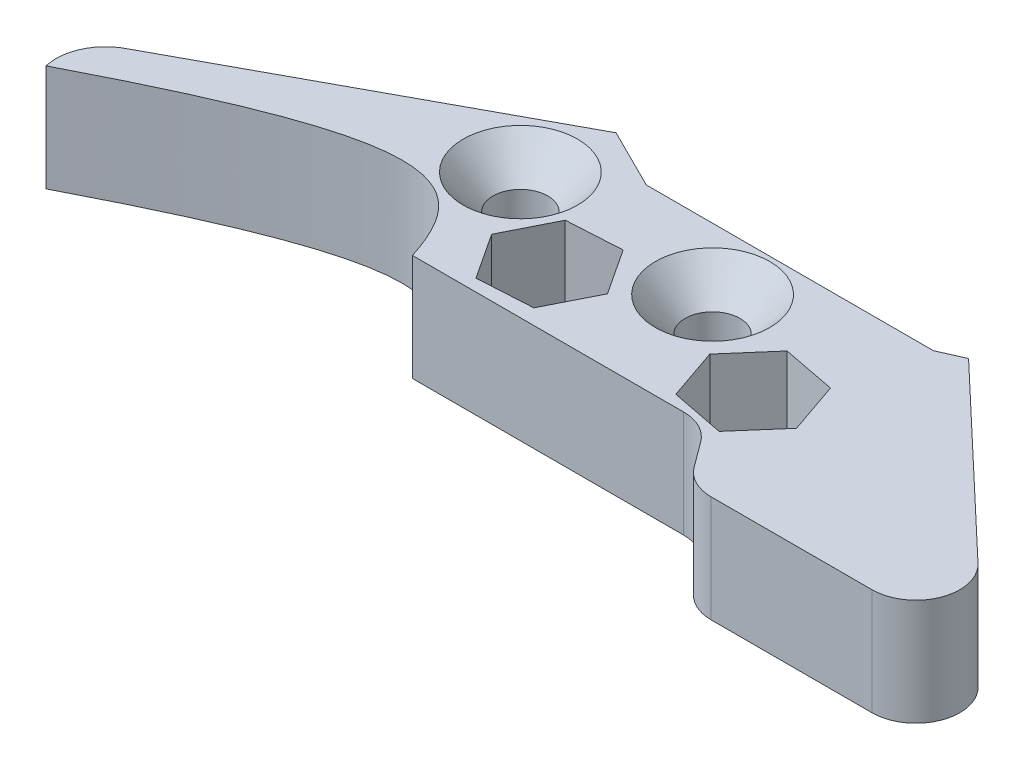
ISO-10303-21;
HEADER;
FILE_DESCRIPTION(('STEP AP214'),'2;1');
FILE_NAME('part.step','',(''),(''),'','','');
FILE_SCHEMA(('AUTOMOTIVE_DESIGN { 1 0 10303 214 1 1 1 1 }'));
ENDSEC;
DATA;
#1=APPLICATION_CONTEXT('core data for automotive mechanical design processes');
#2=APPLICATION_PROTOCOL_DEFINITION('international standard','automotive_design',2000,#1);
#3=PRODUCT_CONTEXT('',#1,'mechanical');
#4=PRODUCT('Part','Part','',(#3));
#5=PRODUCT_RELATED_PRODUCT_CATEGORY('part','',(#4));
#6=PRODUCT_DEFINITION_FORMATION('','',#4);
#7=PRODUCT_DEFINITION_CONTEXT('part definition',#1,'design');
#8=PRODUCT_DEFINITION('design','',#6,#7);
#9=PRODUCT_DEFINITION_SHAPE('','',#8);
#10=(LENGTH_UNIT() NAMED_UNIT(*) SI_UNIT(.MILLI.,.METRE.));
#11=(NAMED_UNIT(*) PLANE_ANGLE_UNIT() SI_UNIT($,.RADIAN.));
#12=(NAMED_UNIT(*) SI_UNIT($,.STERADIAN.) SOLID_ANGLE_UNIT());
#13=UNCERTAINTY_MEASURE_WITH_UNIT(LENGTH_MEASURE(1.E-05),#10,'distance_accuracy_value','');
#14=(GEOMETRIC_REPRESENTATION_CONTEXT(3) GLOBAL_UNCERTAINTY_ASSIGNED_CONTEXT((#13)) GLOBAL_UNIT_ASSIGNED_CONTEXT((#10,
#11,#12)) REPRESENTATION_CONTEXT('',''));
#15=CARTESIAN_POINT('',(0.,0.,0.));
#16=DIRECTION('',(0.,0.,1.));
#17=DIRECTION('',(1.,0.,0.));
#18=AXIS2_PLACEMENT_3D('',#15,#16,#17);
#19=CARTESIAN_POINT('',(94.6464873577747,12.7,72.0035423667846));
#20=DIRECTION('',(0.,-1.,0.));
#21=DIRECTION('',(0.,0.,-1.));
#22=AXIS2_PLACEMENT_3D('',#19,#20,#21);
#23=PLANE('',#22);
#24=DIRECTION('',(-0.325094026600818,0.,-0.945681697966322));
#25=VECTOR('',#24,1.);
#26=CARTESIAN_POINT('',(103.042754495352,12.7,61.8834156539618));
#27=LINE('',#26,#25);
#28=CARTESIAN_POINT('',(103.042754495352,12.7,61.8834156539618));
#29=VERTEX_POINT('',#28);
#30=CARTESIAN_POINT('',(100.918875414709,12.7,55.7051613308697));
#31=VERTEX_POINT('',#30);
#32=EDGE_CURVE('E233',#29,#31,#27,.T.);
#33=ORIENTED_EDGE('',*,*,#32,.F.);
#34=DIRECTION('',(0.656437361032428,0.,-0.754380534638044));
#35=VECTOR('',#34,1.);
#36=CARTESIAN_POINT('',(98.7541688408353,12.7,66.8118760539113));
#37=LINE('',#36,#35);
#38=CARTESIAN_POINT('',(98.7541688408353,12.7,66.8118760539113));
#39=VERTEX_POINT('',#38);
#40=EDGE_CURVE('E48',#39,#29,#37,.T.);
#41=ORIENTED_EDGE('',*,*,#40,.F.);
#42=DIRECTION('',(0.981531387633247,0.,0.191301163328279));
#43=VECTOR('',#42,1.);
#44=CARTESIAN_POINT('',(92.341704105675,12.7,65.5620821307687));
#45=LINE('',#44,#43);
#46=CARTESIAN_POINT('',(92.341704105675,12.7,65.5620821307687));
#47=VERTEX_POINT('',#46);
#48=EDGE_CURVE('E219',#47,#39,#45,.T.);
#49=ORIENTED_EDGE('',*,*,#48,.F.);
#50=DIRECTION('',(0.325094026600819,0.,0.945681697966322));
#51=VECTOR('',#50,1.);
#52=CARTESIAN_POINT('',(90.2178250250317,12.7,59.3838278076766));
#53=LINE('',#52,#51);
#54=CARTESIAN_POINT('',(90.2178250250317,12.7,59.3838278076766));
#55=VERTEX_POINT('',#54);
#56=EDGE_CURVE('E222',#55,#47,#53,.T.);
#57=ORIENTED_EDGE('',*,*,#56,.F.);
#58=DIRECTION('',(-0.656437361032427,0.,0.754380534638045));
#59=VECTOR('',#58,1.);
#60=CARTESIAN_POINT('',(94.5064106795488,12.7,54.4553674077271));
#61=LINE('',#60,#59);
#62=CARTESIAN_POINT('',(94.5064106795488,12.7,54.4553674077271));
#63=VERTEX_POINT('',#62);
#64=EDGE_CURVE('E238',#63,#55,#61,.T.);
#65=ORIENTED_EDGE('',*,*,#64,.F.);
#66=DIRECTION('',(-0.981531387633247,0.,-0.191301163328281));
#67=VECTOR('',#66,1.);
#68=CARTESIAN_POINT('',(100.918875414709,12.7,55.7051613308697));
#69=LINE('',#68,#67);
#70=EDGE_CURVE('E235',#31,#63,#69,.T.);
#71=ORIENTED_EDGE('',*,*,#70,.F.);
#72=EDGE_LOOP('',(#33,#41,#49,#57,#65,#71));
#73=FACE_BOUND('',#72,.T.);
#74=DIRECTION('',(-0.549331813708706,0.,-0.835604307341402));
#75=VECTOR('',#74,1.);
#76=CARTESIAN_POINT('',(77.8985654299266,12.7,59.2633655193393));
#77=LINE('',#76,#75);
#78=CARTESIAN_POINT('',(77.8985654299266,12.7,59.2633655193393));
#79=VERTEX_POINT('',#78);
#80=CARTESIAN_POINT('',(74.3097134301931,12.7,53.8042602671933));
#81=VERTEX_POINT('',#80);
#82=EDGE_CURVE('E274',#79,#81,#77,.T.);
#83=ORIENTED_EDGE('',*,*,#82,.F.);
#84=DIRECTION('',(0.448988650815002,0.,-0.89353745944942));
#85=VECTOR('',#84,1.);
#86=CARTESIAN_POINT('',(74.9652675995018,12.7,65.1009551476041));
#87=LINE('',#86,#85);
#88=CARTESIAN_POINT('',(74.9652675995018,12.7,65.1009551476041));
#89=VERTEX_POINT('',#88);
#90=EDGE_CURVE('E245',#89,#79,#87,.T.);
#91=ORIENTED_EDGE('',*,*,#90,.F.);
#92=DIRECTION('',(0.998320464523706,0.,-0.0579331521080203));
#93=VECTOR('',#92,1.);
#94=CARTESIAN_POINT('',(68.4431177693435,12.7,65.4794395237229));
#95=LINE('',#94,#93);
#96=CARTESIAN_POINT('',(68.4431177693435,12.7,65.4794395237229));
#97=VERTEX_POINT('',#96);
#98=EDGE_CURVE('E257',#97,#89,#95,.T.);
#99=ORIENTED_EDGE('',*,*,#98,.F.);
#100=DIRECTION('',(0.549331813708702,0.,0.835604307341404));
#101=VECTOR('',#100,1.);
#102=CARTESIAN_POINT('',(64.85426576961,12.7,60.0203342715768));
#103=LINE('',#102,#101);
#104=CARTESIAN_POINT('',(64.85426576961,12.7,60.0203342715768));
#105=VERTEX_POINT('',#104);
#106=EDGE_CURVE('E283',#105,#97,#103,.T.);
#107=ORIENTED_EDGE('',*,*,#106,.F.);
#108=DIRECTION('',(-0.448988650815002,0.,0.89353745944942));
#109=VECTOR('',#108,1.);
#110=CARTESIAN_POINT('',(67.7875636000348,12.7,54.182744643312));
#111=LINE('',#110,#109);
#112=CARTESIAN_POINT('',(67.7875636000348,12.7,54.182744643312));
#113=VERTEX_POINT('',#112);
#114=EDGE_CURVE('E280',#113,#105,#111,.T.);
#115=ORIENTED_EDGE('',*,*,#114,.F.);
#116=DIRECTION('',(-0.998320464523706,0.,0.0579331521080192));
#117=VECTOR('',#116,1.);
#118=CARTESIAN_POINT('',(74.3097134301931,12.7,53.8042602671933));
#119=LINE('',#118,#117);
#120=EDGE_CURVE('E277',#81,#113,#119,.T.);
#121=ORIENTED_EDGE('',*,*,#120,.F.);
#122=EDGE_LOOP('',(#83,#91,#99,#107,#115,#121));
#123=FACE_BOUND('',#122,.T.);
#124=CARTESIAN_POINT('',(84.2377296989938,12.7,53.0770811690459));
#125=DIRECTION('',(0.,-1.,0.));
#126=DIRECTION('',(0.,0.,-1.));
#127=AXIS2_PLACEMENT_3D('',#124,#125,#126);
#128=CIRCLE('',#127,6.81876118562569);
#129=CARTESIAN_POINT('',(84.2377296989938,12.7,46.2583199834202));
#130=VERTEX_POINT('',#129);
#131=EDGE_CURVE('E41',#130,#130,#128,.T.);
#132=ORIENTED_EDGE('',*,*,#131,.T.);
#133=EDGE_LOOP('',(#132));
#134=FACE_BOUND('',#133,.T.);
#135=CARTESIAN_POINT('',(60.1501706674325,12.7,51.8912018263475));
#136=DIRECTION('',(0.,-1.,0.));
#137=DIRECTION('',(0.,0.,-1.));
#138=AXIS2_PLACEMENT_3D('',#135,#136,#137);
#139=CIRCLE('',#138,6.81876118562569);
#140=CARTESIAN_POINT('',(60.1501706674325,12.7,45.0724406407218));
#141=VERTEX_POINT('',#140);
#142=EDGE_CURVE('E724',#141,#141,#139,.T.);
#143=ORIENTED_EDGE('',*,*,#142,.T.);
#144=EDGE_LOOP('',(#143));
#145=FACE_BOUND('',#144,.T.);
#146=CARTESIAN_POINT('',(94.6464873577747,12.7,72.0035423667846));
#147=DIRECTION('',(0.,-1.,0.));
#148=DIRECTION('',(0.,0.,-1.));
#149=AXIS2_PLACEMENT_3D('',#146,#147,#148);
#150=CIRCLE('',#149,5.07999999999994);
#151=CARTESIAN_POINT('',(94.6464873577746,12.7,66.9235423667847));
#152=VERTEX_POINT('',#151);
#153=CARTESIAN_POINT('',(98.7330315728584,12.7,68.9858352275538));
#154=VERTEX_POINT('',#153);
#155=EDGE_CURVE('E307',#152,#154,#150,.T.);
#156=ORIENTED_EDGE('',*,*,#155,.T.);
#157=DIRECTION('',(0.594036838431286,0.,0.804437837614916));
#158=VECTOR('',#157,1.);
#159=CARTESIAN_POINT('',(98.7330315728584,12.7,68.9858352275538));
#160=LINE('',#159,#158);
#161=CARTESIAN_POINT('',(100.942599671675,12.7,71.9780068716037));
#162=VERTEX_POINT('',#161);
#163=EDGE_CURVE('E310',#154,#162,#160,.T.);
#164=ORIENTED_EDGE('',*,*,#163,.T.);
#165=CARTESIAN_POINT('',(105.029143886759,12.7,68.9602997323728));
#166=DIRECTION('',(0.,1.,0.));
#167=DIRECTION('',(0.,0.,1.));
#168=AXIS2_PLACEMENT_3D('',#165,#166,#167);
#169=CIRCLE('',#168,5.08000000000005);
#170=CARTESIAN_POINT('',(105.029143886759,12.7,74.0402997323728));
#171=VERTEX_POINT('',#170);
#172=EDGE_CURVE('E313',#162,#171,#169,.T.);
#173=ORIENTED_EDGE('',*,*,#172,.T.);
#174=DIRECTION('',(1.,0.,0.));
#175=VECTOR('',#174,1.);
#176=CARTESIAN_POINT('',(124.201892168359,12.7,74.0402997323728));
#177=LINE('',#176,#175);
#178=CARTESIAN_POINT('',(124.201892168359,12.7,74.0402997323728));
#179=VERTEX_POINT('',#178);
#180=EDGE_CURVE('E315',#171,#179,#177,.T.);
#181=ORIENTED_EDGE('',*,*,#180,.T.);
#182=CARTESIAN_POINT('',(124.201892168359,12.7,68.8073629089904));
#183=DIRECTION('',(0.,1.,0.));
#184=DIRECTION('',(0.,0.,-1.));
#185=AXIS2_PLACEMENT_3D('',#182,#183,#184);
#186=CIRCLE('',#185,5.23293682338238);
#187=CARTESIAN_POINT('',(127.802444271928,12.7,65.0100411755846));
#188=VERTEX_POINT('',#187);
#189=EDGE_CURVE('E317',#179,#188,#186,.T.);
#190=ORIENTED_EDGE('',*,*,#189,.T.);
#191=DIRECTION('',(-0.725657859356962,0.,-0.688055718058843));
#192=VECTOR('',#191,1.);
#193=CARTESIAN_POINT('',(106.094318665157,12.7,44.4267872915648));
#194=LINE('',#193,#192);
#195=CARTESIAN_POINT('',(106.094318665157,12.7,44.4267872915648));
#196=VERTEX_POINT('',#195);
#197=EDGE_CURVE('E319',#188,#196,#194,.T.);
#198=ORIENTED_EDGE('',*,*,#197,.T.);
#199=DIRECTION('',(-0.913865355224229,0.,0.406017379579858));
#200=VECTOR('',#199,1.);
#201=CARTESIAN_POINT('',(103.198208610252,12.7,45.7134877980947));
#202=LINE('',#201,#200);
#203=CARTESIAN_POINT('',(103.198208610252,12.7,45.7134877980947));
#204=VERTEX_POINT('',#203);
#205=EDGE_CURVE('E321',#196,#204,#202,.T.);
#206=ORIENTED_EDGE('',*,*,#205,.T.);
#207=DIRECTION('',(-1.,0.,0.));
#208=VECTOR('',#207,1.);
#209=CARTESIAN_POINT('',(68.9773529785824,12.7,45.7134877980947));
#210=LINE('',#209,#208);
#211=CARTESIAN_POINT('',(68.9773529785824,12.7,45.7134877980947));
#212=VERTEX_POINT('',#211);
#213=EDGE_CURVE('E323',#204,#212,#210,.T.);
#214=ORIENTED_EDGE('',*,*,#213,.T.);
#215=DIRECTION('',(-0.894952635956542,0.,-0.446161158545247));
#216=VECTOR('',#215,1.);
#217=CARTESIAN_POINT('',(61.7923746069424,12.7,42.1315571510195));
#218=LINE('',#217,#216);
#219=CARTESIAN_POINT('',(61.7923746069424,12.7,42.1315571510195));
#220=VERTEX_POINT('',#219);
#221=EDGE_CURVE('E325',#212,#220,#218,.T.);
#222=ORIENTED_EDGE('',*,*,#221,.T.);
#223=DIRECTION('',(-0.879472036530174,0.,0.475950561467751));
#224=VECTOR('',#223,1.);
#225=CARTESIAN_POINT('',(61.7923746069424,12.7,42.1315571510195));
#226=LINE('',#225,#224);
#227=CARTESIAN_POINT('',(24.0382702458986,12.7,62.5632325448674));
#228=VERTEX_POINT('',#227);
#229=EDGE_CURVE('E327',#220,#228,#226,.T.);
#230=ORIENTED_EDGE('',*,*,#229,.T.);
#231=CARTESIAN_POINT('',(26.6540797968948,12.7,67.8447610872686));
#232=DIRECTION('',(0.,1.,0.));
#233=DIRECTION('',(0.,0.,1.));
#234=AXIS2_PLACEMENT_3D('',#231,#232,#233);
#235=CIRCLE('',#234,5.89381059682799);
#236=CARTESIAN_POINT('',(20.9153808048785,12.7,69.1880172915401));
#237=VERTEX_POINT('',#236);
#238=EDGE_CURVE('E329',#228,#237,#235,.T.);
#239=ORIENTED_EDGE('',*,*,#238,.T.);
#240=CARTESIAN_POINT('',(20.9153808048785,12.7,69.1880172915401));
#241=CARTESIAN_POINT('',(51.4997702665932,12.7,53.452589153188));
#242=CARTESIAN_POINT('',(58.5691183034685,12.7,55.0434602734687));
#243=CARTESIAN_POINT('',(62.3156112886472,12.7,66.9235423667847));
#244=B_SPLINE_CURVE_WITH_KNOTS('',3,(#240,#241,#242,#243),.UNSPECIFIED.,.F.,.F.,(4,4),(0.,1.),.UNSPECIFIED.);
#245=CARTESIAN_POINT('',(62.3156112886472,12.7,66.9235423667847));
#246=VERTEX_POINT('',#245);
#247=EDGE_CURVE('E331',#237,#246,#244,.T.);
#248=ORIENTED_EDGE('',*,*,#247,.T.);
#249=DIRECTION('',(1.,0.,0.));
#250=VECTOR('',#249,1.);
#251=CARTESIAN_POINT('',(62.3156112886472,12.7,66.9235423667847));
#252=LINE('',#251,#250);
#253=EDGE_CURVE('E336',#246,#152,#252,.T.);
#254=ORIENTED_EDGE('',*,*,#253,.T.);
#255=EDGE_LOOP('',(#156,#164,#173,#181,#190,#198,#206,#214,#222,#230,#239,#248,#254));
#256=FACE_BOUND('',#255,.T.);
#257=ADVANCED_FACE('F33',(#73,#123,#134,#145,#256),#23,.F.);
#258=CARTESIAN_POINT('',(94.6464873577747,0.,72.0035423667846));
#259=DIRECTION('',(0.,-1.,0.));
#260=DIRECTION('',(0.,0.,-1.));
#261=AXIS2_PLACEMENT_3D('',#258,#259,#260);
#262=PLANE('',#261);
#263=DIRECTION('',(0.656437361032428,0.,-0.754380534638044));
#264=VECTOR('',#263,1.);
#265=CARTESIAN_POINT('',(98.7541688408353,0.,66.8118760539113));
#266=LINE('',#265,#264);
#267=CARTESIAN_POINT('',(98.7541688408353,0.,66.8118760539113));
#268=VERTEX_POINT('',#267);
#269=CARTESIAN_POINT('',(103.042754495352,0.,61.8834156539618));
#270=VERTEX_POINT('',#269);
#271=EDGE_CURVE('E202',#268,#270,#266,.T.);
#272=ORIENTED_EDGE('',*,*,#271,.T.);
#273=DIRECTION('',(-0.325094026600818,0.,-0.945681697966322));
#274=VECTOR('',#273,1.);
#275=CARTESIAN_POINT('',(103.042754495352,0.,61.8834156539618));
#276=LINE('',#275,#274);
#277=CARTESIAN_POINT('',(100.918875414709,0.,55.7051613308697));
#278=VERTEX_POINT('',#277);
#279=EDGE_CURVE('E211',#270,#278,#276,.T.);
#280=ORIENTED_EDGE('',*,*,#279,.T.);
#281=DIRECTION('',(-0.981531387633247,0.,-0.191301163328281));
#282=VECTOR('',#281,1.);
#283=CARTESIAN_POINT('',(100.918875414709,0.,55.7051613308697));
#284=LINE('',#283,#282);
#285=CARTESIAN_POINT('',(94.5064106795488,0.,54.4553674077271));
#286=VERTEX_POINT('',#285);
#287=EDGE_CURVE('E56',#278,#286,#284,.T.);
#288=ORIENTED_EDGE('',*,*,#287,.T.);
#289=DIRECTION('',(-0.656437361032427,0.,0.754380534638045));
#290=VECTOR('',#289,1.);
#291=CARTESIAN_POINT('',(94.5064106795488,0.,54.4553674077271));
#292=LINE('',#291,#290);
#293=CARTESIAN_POINT('',(90.2178250250317,0.,59.3838278076766));
#294=VERTEX_POINT('',#293);
#295=EDGE_CURVE('E226',#286,#294,#292,.T.);
#296=ORIENTED_EDGE('',*,*,#295,.T.);
#297=DIRECTION('',(0.325094026600819,0.,0.945681697966322));
#298=VECTOR('',#297,1.);
#299=CARTESIAN_POINT('',(90.2178250250317,0.,59.3838278076766));
#300=LINE('',#299,#298);
#301=CARTESIAN_POINT('',(92.341704105675,0.,65.5620821307687));
#302=VERTEX_POINT('',#301);
#303=EDGE_CURVE('E229',#294,#302,#300,.T.);
#304=ORIENTED_EDGE('',*,*,#303,.T.);
#305=DIRECTION('',(0.981531387633247,0.,0.191301163328279));
#306=VECTOR('',#305,1.);
#307=CARTESIAN_POINT('',(92.341704105675,0.,65.5620821307687));
#308=LINE('',#307,#306);
#309=EDGE_CURVE('E208',#302,#268,#308,.T.);
#310=ORIENTED_EDGE('',*,*,#309,.T.);
#311=EDGE_LOOP('',(#272,#280,#288,#296,#304,#310));
#312=FACE_BOUND('',#311,.T.);
#313=DIRECTION('',(0.448988650815002,0.,-0.89353745944942));
#314=VECTOR('',#313,1.);
#315=CARTESIAN_POINT('',(74.9652675995018,0.,65.1009551476041));
#316=LINE('',#315,#314);
#317=CARTESIAN_POINT('',(74.9652675995018,0.,65.1009551476041));
#318=VERTEX_POINT('',#317);
#319=CARTESIAN_POINT('',(77.8985654299266,0.,59.2633655193393));
#320=VERTEX_POINT('',#319);
#321=EDGE_CURVE('E253',#318,#320,#316,.T.);
#322=ORIENTED_EDGE('',*,*,#321,.T.);
#323=DIRECTION('',(-0.549331813708706,0.,-0.835604307341402));
#324=VECTOR('',#323,1.);
#325=CARTESIAN_POINT('',(77.8985654299266,0.,59.2633655193393));
#326=LINE('',#325,#324);
#327=CARTESIAN_POINT('',(74.3097134301931,0.,53.8042602671933));
#328=VERTEX_POINT('',#327);
#329=EDGE_CURVE('E256',#320,#328,#326,.T.);
#330=ORIENTED_EDGE('',*,*,#329,.T.);
#331=DIRECTION('',(-0.998320464523706,0.,0.0579331521080192));
#332=VECTOR('',#331,1.);
#333=CARTESIAN_POINT('',(74.3097134301931,0.,53.8042602671933));
#334=LINE('',#333,#332);
#335=CARTESIAN_POINT('',(67.7875636000348,0.,54.182744643312));
#336=VERTEX_POINT('',#335);
#337=EDGE_CURVE('E260',#328,#336,#334,.T.);
#338=ORIENTED_EDGE('',*,*,#337,.T.);
#339=DIRECTION('',(-0.448988650815002,0.,0.89353745944942));
#340=VECTOR('',#339,1.);
#341=CARTESIAN_POINT('',(67.7875636000348,0.,54.182744643312));
#342=LINE('',#341,#340);
#343=CARTESIAN_POINT('',(64.85426576961,0.,60.0203342715768));
#344=VERTEX_POINT('',#343);
#345=EDGE_CURVE('E263',#336,#344,#342,.T.);
#346=ORIENTED_EDGE('',*,*,#345,.T.);
#347=DIRECTION('',(0.549331813708702,0.,0.835604307341404));
#348=VECTOR('',#347,1.);
#349=CARTESIAN_POINT('',(64.85426576961,0.,60.0203342715768));
#350=LINE('',#349,#348);
#351=CARTESIAN_POINT('',(68.4431177693435,0.,65.4794395237229));
#352=VERTEX_POINT('',#351);
#353=EDGE_CURVE('E266',#344,#352,#350,.T.);
#354=ORIENTED_EDGE('',*,*,#353,.T.);
#355=DIRECTION('',(0.998320464523706,0.,-0.0579331521080203));
#356=VECTOR('',#355,1.);
#357=CARTESIAN_POINT('',(68.4431177693435,0.,65.4794395237229));
#358=LINE('',#357,#356);
#359=EDGE_CURVE('E269',#352,#318,#358,.T.);
#360=ORIENTED_EDGE('',*,*,#359,.T.);
#361=EDGE_LOOP('',(#322,#330,#338,#346,#354,#360));
#362=FACE_BOUND('',#361,.T.);
#363=CARTESIAN_POINT('',(84.2377296989938,0.,53.0770811690459));
#364=DIRECTION('',(0.,1.,0.));
#365=DIRECTION('',(0.,0.,1.));
#366=AXIS2_PLACEMENT_3D('',#363,#364,#365);
#367=CIRCLE('',#366,3.2639);
#368=CARTESIAN_POINT('',(84.2377296989938,0.,56.3409811690459));
#369=VERTEX_POINT('',#368);
#370=EDGE_CURVE('E290',#369,#369,#367,.T.);
#371=ORIENTED_EDGE('',*,*,#370,.T.);
#372=EDGE_LOOP('',(#371));
#373=FACE_BOUND('',#372,.T.);
#374=CARTESIAN_POINT('',(60.1501706674325,0.,51.8912018263475));
#375=DIRECTION('',(0.,1.,0.));
#376=DIRECTION('',(0.,0.,1.));
#377=AXIS2_PLACEMENT_3D('',#374,#375,#376);
#378=CIRCLE('',#377,3.2639);
#379=CARTESIAN_POINT('',(60.1501706674325,0.,55.1551018263475));
#380=VERTEX_POINT('',#379);
#381=EDGE_CURVE('E303',#380,#380,#378,.T.);
#382=ORIENTED_EDGE('',*,*,#381,.T.);
#383=EDGE_LOOP('',(#382));
#384=FACE_BOUND('',#383,.T.);
#385=CARTESIAN_POINT('',(94.6464873577747,0.,72.0035423667846));
#386=DIRECTION('',(0.,-1.,0.));
#387=DIRECTION('',(0.,0.,-1.));
#388=AXIS2_PLACEMENT_3D('',#385,#386,#387);
#389=CIRCLE('',#388,5.07999999999994);
#390=CARTESIAN_POINT('',(94.6464873577746,0.,66.9235423667847));
#391=VERTEX_POINT('',#390);
#392=CARTESIAN_POINT('',(98.7330315728584,0.,68.9858352275538));
#393=VERTEX_POINT('',#392);
#394=EDGE_CURVE('E306',#391,#393,#389,.T.);
#395=ORIENTED_EDGE('',*,*,#394,.F.);
#396=DIRECTION('',(1.,0.,0.));
#397=VECTOR('',#396,1.);
#398=CARTESIAN_POINT('',(62.3156112886472,0.,66.9235423667847));
#399=LINE('',#398,#397);
#400=CARTESIAN_POINT('',(62.3156112886472,0.,66.9235423667847));
#401=VERTEX_POINT('',#400);
#402=EDGE_CURVE('E311',#401,#391,#399,.T.);
#403=ORIENTED_EDGE('',*,*,#402,.F.);
#404=CARTESIAN_POINT('',(20.9153808048785,0.,69.1880172915401));
#405=CARTESIAN_POINT('',(51.4997702665932,0.,53.452589153188));
#406=CARTESIAN_POINT('',(58.5691183034685,0.,55.0434602734687));
#407=CARTESIAN_POINT('',(62.3156112886472,0.,66.9235423667847));
#408=B_SPLINE_CURVE_WITH_KNOTS('',3,(#404,#405,#406,#407),.UNSPECIFIED.,.F.,.F.,(4,4),(0.,1.),.UNSPECIFIED.);
#409=CARTESIAN_POINT('',(20.9153808048785,0.,69.1880172915401));
#410=VERTEX_POINT('',#409);
#411=EDGE_CURVE('E654',#410,#401,#408,.T.);
#412=ORIENTED_EDGE('',*,*,#411,.F.);
#413=CARTESIAN_POINT('',(26.6540797968948,0.,67.8447610872686));
#414=DIRECTION('',(0.,1.,0.));
#415=DIRECTION('',(0.,0.,1.));
#416=AXIS2_PLACEMENT_3D('',#413,#414,#415);
#417=CIRCLE('',#416,5.89381059682799);
#418=CARTESIAN_POINT('',(24.0382702458986,0.,62.5632325448674));
#419=VERTEX_POINT('',#418);
#420=EDGE_CURVE('E680',#419,#410,#417,.T.);
#421=ORIENTED_EDGE('',*,*,#420,.F.);
#422=DIRECTION('',(-0.879472036530174,0.,0.475950561467751));
#423=VECTOR('',#422,1.);
#424=CARTESIAN_POINT('',(61.7923746069424,0.,42.1315571510195));
#425=LINE('',#424,#423);
#426=CARTESIAN_POINT('',(61.7923746069424,0.,42.1315571510195));
#427=VERTEX_POINT('',#426);
#428=EDGE_CURVE('E678',#427,#419,#425,.T.);
#429=ORIENTED_EDGE('',*,*,#428,.F.);
#430=DIRECTION('',(-0.894952635956542,0.,-0.446161158545247));
#431=VECTOR('',#430,1.);
#432=CARTESIAN_POINT('',(61.7923746069424,0.,42.1315571510195));
#433=LINE('',#432,#431);
#434=CARTESIAN_POINT('',(68.9773529785824,0.,45.7134877980947));
#435=VERTEX_POINT('',#434);
#436=EDGE_CURVE('E676',#435,#427,#433,.T.);
#437=ORIENTED_EDGE('',*,*,#436,.F.);
#438=DIRECTION('',(-1.,0.,0.));
#439=VECTOR('',#438,1.);
#440=CARTESIAN_POINT('',(68.9773529785824,0.,45.7134877980947));
#441=LINE('',#440,#439);
#442=CARTESIAN_POINT('',(103.198208610252,0.,45.7134877980947));
#443=VERTEX_POINT('',#442);
#444=EDGE_CURVE('E674',#443,#435,#441,.T.);
#445=ORIENTED_EDGE('',*,*,#444,.F.);
#446=DIRECTION('',(-0.913865355224229,0.,0.406017379579858));
#447=VECTOR('',#446,1.);
#448=CARTESIAN_POINT('',(103.198208610252,0.,45.7134877980947));
#449=LINE('',#448,#447);
#450=CARTESIAN_POINT('',(106.094318665157,0.,44.4267872915648));
#451=VERTEX_POINT('',#450);
#452=EDGE_CURVE('E672',#451,#443,#449,.T.);
#453=ORIENTED_EDGE('',*,*,#452,.F.);
#454=DIRECTION('',(-0.725657859356962,0.,-0.688055718058843));
#455=VECTOR('',#454,1.);
#456=CARTESIAN_POINT('',(106.094318665157,0.,44.4267872915648));
#457=LINE('',#456,#455);
#458=CARTESIAN_POINT('',(127.802444271928,0.,65.0100411755846));
#459=VERTEX_POINT('',#458);
#460=EDGE_CURVE('E670',#459,#451,#457,.T.);
#461=ORIENTED_EDGE('',*,*,#460,.F.);
#462=CARTESIAN_POINT('',(124.201892168359,0.,68.8073629089904));
#463=DIRECTION('',(0.,1.,0.));
#464=DIRECTION('',(0.,0.,-1.));
#465=AXIS2_PLACEMENT_3D('',#462,#463,#464);
#466=CIRCLE('',#465,5.23293682338238);
#467=CARTESIAN_POINT('',(124.201892168359,0.,74.0402997323728));
#468=VERTEX_POINT('',#467);
#469=EDGE_CURVE('E668',#468,#459,#466,.T.);
#470=ORIENTED_EDGE('',*,*,#469,.F.);
#471=DIRECTION('',(1.,0.,0.));
#472=VECTOR('',#471,1.);
#473=CARTESIAN_POINT('',(124.201892168359,0.,74.0402997323728));
#474=LINE('',#473,#472);
#475=CARTESIAN_POINT('',(105.029143886759,0.,74.0402997323728));
#476=VERTEX_POINT('',#475);
#477=EDGE_CURVE('E666',#476,#468,#474,.T.);
#478=ORIENTED_EDGE('',*,*,#477,.F.);
#479=CARTESIAN_POINT('',(105.029143886759,0.,68.9602997323728));
#480=DIRECTION('',(0.,1.,0.));
#481=DIRECTION('',(0.,0.,1.));
#482=AXIS2_PLACEMENT_3D('',#479,#480,#481);
#483=CIRCLE('',#482,5.08000000000005);
#484=CARTESIAN_POINT('',(100.942599671675,0.,71.9780068716037));
#485=VERTEX_POINT('',#484);
#486=EDGE_CURVE('E662',#485,#476,#483,.T.);
#487=ORIENTED_EDGE('',*,*,#486,.F.);
#488=DIRECTION('',(0.594036838431286,0.,0.804437837614916));
#489=VECTOR('',#488,1.);
#490=CARTESIAN_POINT('',(98.7330315728584,0.,68.9858352275538));
#491=LINE('',#490,#489);
#492=EDGE_CURVE('E660',#393,#485,#491,.T.);
#493=ORIENTED_EDGE('',*,*,#492,.F.);
#494=EDGE_LOOP('',(#395,#403,#412,#421,#429,#437,#445,#453,#461,#470,#478,#487,#493));
#495=FACE_BOUND('',#494,.T.);
#496=ADVANCED_FACE('F215',(#312,#362,#373,#384,#495),#262,.T.);
#497=CARTESIAN_POINT('',(94.6464873577747,12.7,72.0035423667846));
#498=DIRECTION('',(0.,-1.,0.));
#499=DIRECTION('',(0.,0.,-1.));
#500=AXIS2_PLACEMENT_3D('',#497,#498,#499);
#501=CYLINDRICAL_SURFACE('',#500,5.07999999999994);
#502=ORIENTED_EDGE('',*,*,#394,.T.);
#503=DIRECTION('',(0.,-1.,0.));
#504=VECTOR('',#503,1.);
#505=CARTESIAN_POINT('',(98.7330315728584,12.7,68.9858352275538));
#506=LINE('',#505,#504);
#507=EDGE_CURVE('E719',#154,#393,#506,.T.);
#508=ORIENTED_EDGE('',*,*,#507,.F.);
#509=ORIENTED_EDGE('',*,*,#155,.F.);
#510=DIRECTION('',(0.,-1.,0.));
#511=VECTOR('',#510,1.);
#512=CARTESIAN_POINT('',(94.6464873577746,12.7,66.9235423667847));
#513=LINE('',#512,#511);
#514=EDGE_CURVE('E647',#152,#391,#513,.T.);
#515=ORIENTED_EDGE('',*,*,#514,.T.);
#516=EDGE_LOOP('',(#502,#508,#509,#515));
#517=FACE_BOUND('',#516,.T.);
#518=ADVANCED_FACE('F388',(#517),#501,.F.);
#519=CARTESIAN_POINT('',(98.7330315728584,12.7,68.9858352275538));
#520=DIRECTION('',(0.804437837614916,0.,-0.594036838431286));
#521=DIRECTION('',(-0.594036838431286,0.,-0.804437837614916));
#522=AXIS2_PLACEMENT_3D('',#519,#520,#521);
#523=PLANE('',#522);
#524=ORIENTED_EDGE('',*,*,#492,.T.);
#525=DIRECTION('',(0.,-1.,0.));
#526=VECTOR('',#525,1.);
#527=CARTESIAN_POINT('',(100.942599671675,12.7,71.9780068716037));
#528=LINE('',#527,#526);
#529=EDGE_CURVE('E716',#162,#485,#528,.T.);
#530=ORIENTED_EDGE('',*,*,#529,.F.);
#531=ORIENTED_EDGE('',*,*,#163,.F.);
#532=ORIENTED_EDGE('',*,*,#507,.T.);
#533=EDGE_LOOP('',(#524,#530,#531,#532));
#534=FACE_BOUND('',#533,.T.);
#535=ADVANCED_FACE('F384',(#534),#523,.F.);
#536=CARTESIAN_POINT('',(105.029143886759,12.7,68.9602997323728));
#537=DIRECTION('',(0.,-1.,0.));
#538=DIRECTION('',(0.,0.,-1.));
#539=AXIS2_PLACEMENT_3D('',#536,#537,#538);
#540=CYLINDRICAL_SURFACE('',#539,5.08000000000005);
#541=ORIENTED_EDGE('',*,*,#486,.T.);
#542=DIRECTION('',(0.,-1.,0.));
#543=VECTOR('',#542,1.);
#544=CARTESIAN_POINT('',(105.029143886759,12.7,74.0402997323728));
#545=LINE('',#544,#543);
#546=EDGE_CURVE('E713',#171,#476,#545,.T.);
#547=ORIENTED_EDGE('',*,*,#546,.F.);
#548=ORIENTED_EDGE('',*,*,#172,.F.);
#549=ORIENTED_EDGE('',*,*,#529,.T.);
#550=EDGE_LOOP('',(#541,#547,#548,#549));
#551=FACE_BOUND('',#550,.T.);
#552=ADVANCED_FACE('F380',(#551),#540,.T.);
#553=CARTESIAN_POINT('',(124.201892168359,12.7,74.0402997323728));
#554=DIRECTION('',(0.,0.,-1.));
#555=DIRECTION('',(-1.,0.,0.));
#556=AXIS2_PLACEMENT_3D('',#553,#554,#555);
#557=PLANE('',#556);
#558=ORIENTED_EDGE('',*,*,#477,.T.);
#559=DIRECTION('',(0.,-1.,0.));
#560=VECTOR('',#559,1.);
#561=CARTESIAN_POINT('',(124.201892168359,12.7,74.0402997323728));
#562=LINE('',#561,#560);
#563=EDGE_CURVE('E710',#179,#468,#562,.T.);
#564=ORIENTED_EDGE('',*,*,#563,.F.);
#565=ORIENTED_EDGE('',*,*,#180,.F.);
#566=ORIENTED_EDGE('',*,*,#546,.T.);
#567=EDGE_LOOP('',(#558,#564,#565,#566));
#568=FACE_BOUND('',#567,.T.);
#569=ADVANCED_FACE('F376',(#568),#557,.F.);
#570=CARTESIAN_POINT('',(124.201892168359,12.7,68.8073629089904));
#571=DIRECTION('',(0.,-1.,0.));
#572=DIRECTION('',(0.,0.,-1.));
#573=AXIS2_PLACEMENT_3D('',#570,#571,#572);
#574=CYLINDRICAL_SURFACE('',#573,5.23293682338238);
#575=ORIENTED_EDGE('',*,*,#469,.T.);
#576=DIRECTION('',(0.,-1.,0.));
#577=VECTOR('',#576,1.);
#578=CARTESIAN_POINT('',(127.802444271928,12.7,65.0100411755846));
#579=LINE('',#578,#577);
#580=EDGE_CURVE('E707',#188,#459,#579,.T.);
#581=ORIENTED_EDGE('',*,*,#580,.F.);
#582=ORIENTED_EDGE('',*,*,#189,.F.);
#583=ORIENTED_EDGE('',*,*,#563,.T.);
#584=EDGE_LOOP('',(#575,#581,#582,#583));
#585=FACE_BOUND('',#584,.T.);
#586=ADVANCED_FACE('F372',(#585),#574,.T.);
#587=CARTESIAN_POINT('',(106.094318665157,12.7,44.4267872915648));
#588=DIRECTION('',(-0.688055718058844,0.,0.725657859356962));
#589=DIRECTION('',(0.725657859356962,0.,0.688055718058844));
#590=AXIS2_PLACEMENT_3D('',#587,#588,#589);
#591=PLANE('',#590);
#592=ORIENTED_EDGE('',*,*,#460,.T.);
#593=DIRECTION('',(0.,-1.,0.));
#594=VECTOR('',#593,1.);
#595=CARTESIAN_POINT('',(106.094318665157,12.7,44.4267872915648));
#596=LINE('',#595,#594);
#597=EDGE_CURVE('E704',#196,#451,#596,.T.);
#598=ORIENTED_EDGE('',*,*,#597,.F.);
#599=ORIENTED_EDGE('',*,*,#197,.F.);
#600=ORIENTED_EDGE('',*,*,#580,.T.);
#601=EDGE_LOOP('',(#592,#598,#599,#600));
#602=FACE_BOUND('',#601,.T.);
#603=ADVANCED_FACE('F368',(#602),#591,.F.);
#604=CARTESIAN_POINT('',(103.198208610252,12.7,45.7134877980947));
#605=DIRECTION('',(0.406017379579858,0.,0.913865355224229));
#606=DIRECTION('',(0.913865355224229,0.,-0.406017379579858));
#607=AXIS2_PLACEMENT_3D('',#604,#605,#606);
#608=PLANE('',#607);
#609=ORIENTED_EDGE('',*,*,#452,.T.);
#610=DIRECTION('',(0.,-1.,0.));
#611=VECTOR('',#610,1.);
#612=CARTESIAN_POINT('',(103.198208610252,12.7,45.7134877980947));
#613=LINE('',#612,#611);
#614=EDGE_CURVE('E701',#204,#443,#613,.T.);
#615=ORIENTED_EDGE('',*,*,#614,.F.);
#616=ORIENTED_EDGE('',*,*,#205,.F.);
#617=ORIENTED_EDGE('',*,*,#597,.T.);
#618=EDGE_LOOP('',(#609,#615,#616,#617));
#619=FACE_BOUND('',#618,.T.);
#620=ADVANCED_FACE('F364',(#619),#608,.F.);
#621=CARTESIAN_POINT('',(68.9773529785824,12.7,45.7134877980947));
#622=DIRECTION('',(0.,0.,1.));
#623=DIRECTION('',(1.,0.,0.));
#624=AXIS2_PLACEMENT_3D('',#621,#622,#623);
#625=PLANE('',#624);
#626=ORIENTED_EDGE('',*,*,#444,.T.);
#627=DIRECTION('',(0.,-1.,0.));
#628=VECTOR('',#627,1.);
#629=CARTESIAN_POINT('',(68.9773529785824,12.7,45.7134877980947));
#630=LINE('',#629,#628);
#631=EDGE_CURVE('E698',#212,#435,#630,.T.);
#632=ORIENTED_EDGE('',*,*,#631,.F.);
#633=ORIENTED_EDGE('',*,*,#213,.F.);
#634=ORIENTED_EDGE('',*,*,#614,.T.);
#635=EDGE_LOOP('',(#626,#632,#633,#634));
#636=FACE_BOUND('',#635,.T.);
#637=ADVANCED_FACE('F360',(#636),#625,.F.);
#638=CARTESIAN_POINT('',(61.7923746069424,12.7,42.1315571510195));
#639=DIRECTION('',(-0.446161158545247,0.,0.894952635956542));
#640=DIRECTION('',(0.894952635956542,0.,0.446161158545247));
#641=AXIS2_PLACEMENT_3D('',#638,#639,#640);
#642=PLANE('',#641);
#643=ORIENTED_EDGE('',*,*,#436,.T.);
#644=DIRECTION('',(0.,-1.,0.));
#645=VECTOR('',#644,1.);
#646=CARTESIAN_POINT('',(61.7923746069424,12.7,42.1315571510195));
#647=LINE('',#646,#645);
#648=EDGE_CURVE('E695',#220,#427,#647,.T.);
#649=ORIENTED_EDGE('',*,*,#648,.F.);
#650=ORIENTED_EDGE('',*,*,#221,.F.);
#651=ORIENTED_EDGE('',*,*,#631,.T.);
#652=EDGE_LOOP('',(#643,#649,#650,#651));
#653=FACE_BOUND('',#652,.T.);
#654=ADVANCED_FACE('F356',(#653),#642,.F.);
#655=CARTESIAN_POINT('',(61.7923746069424,12.7,42.1315571510195));
#656=DIRECTION('',(0.475950561467751,0.,0.879472036530174));
#657=DIRECTION('',(0.879472036530175,0.,-0.475950561467751));
#658=AXIS2_PLACEMENT_3D('',#655,#656,#657);
#659=PLANE('',#658);
#660=ORIENTED_EDGE('',*,*,#428,.T.);
#661=DIRECTION('',(0.,-1.,0.));
#662=VECTOR('',#661,1.);
#663=CARTESIAN_POINT('',(24.0382702458986,12.7,62.5632325448674));
#664=LINE('',#663,#662);
#665=EDGE_CURVE('E692',#228,#419,#664,.T.);
#666=ORIENTED_EDGE('',*,*,#665,.F.);
#667=ORIENTED_EDGE('',*,*,#229,.F.);
#668=ORIENTED_EDGE('',*,*,#648,.T.);
#669=EDGE_LOOP('',(#660,#666,#667,#668));
#670=FACE_BOUND('',#669,.T.);
#671=ADVANCED_FACE('F352',(#670),#659,.F.);
#672=CARTESIAN_POINT('',(26.6540797968948,12.7,67.8447610872686));
#673=DIRECTION('',(0.,-1.,0.));
#674=DIRECTION('',(0.,0.,-1.));
#675=AXIS2_PLACEMENT_3D('',#672,#673,#674);
#676=CYLINDRICAL_SURFACE('',#675,5.89381059682799);
#677=ORIENTED_EDGE('',*,*,#420,.T.);
#678=DIRECTION('',(0.,-1.,0.));
#679=VECTOR('',#678,1.);
#680=CARTESIAN_POINT('',(20.9153808048785,12.7,69.1880172915401));
#681=LINE('',#680,#679);
#682=EDGE_CURVE('E689',#237,#410,#681,.T.);
#683=ORIENTED_EDGE('',*,*,#682,.F.);
#684=ORIENTED_EDGE('',*,*,#238,.F.);
#685=ORIENTED_EDGE('',*,*,#665,.T.);
#686=EDGE_LOOP('',(#677,#683,#684,#685));
#687=FACE_BOUND('',#686,.T.);
#688=ADVANCED_FACE('F347',(#687),#676,.T.);
#689=DIRECTION('',(0.,-1.,0.));
#690=VECTOR('',#689,1.);
#691=SURFACE_OF_LINEAR_EXTRUSION('',#244,#690);
#692=ORIENTED_EDGE('',*,*,#411,.T.);
#693=DIRECTION('',(0.,-1.,0.));
#694=VECTOR('',#693,1.);
#695=CARTESIAN_POINT('',(62.3156112886472,12.7,66.9235423667847));
#696=LINE('',#695,#694);
#697=EDGE_CURVE('E650',#246,#401,#696,.T.);
#698=ORIENTED_EDGE('',*,*,#697,.F.);
#699=ORIENTED_EDGE('',*,*,#247,.F.);
#700=ORIENTED_EDGE('',*,*,#682,.T.);
#701=EDGE_LOOP('',(#692,#698,#699,#700));
#702=FACE_BOUND('',#701,.T.);
#703=ADVANCED_FACE('F342',(#702),#691,.F.);
#704=CARTESIAN_POINT('',(62.3156112886472,12.7,66.9235423667847));
#705=DIRECTION('',(0.,0.,-1.));
#706=DIRECTION('',(-1.,0.,0.));
#707=AXIS2_PLACEMENT_3D('',#704,#705,#706);
#708=PLANE('',#707);
#709=ORIENTED_EDGE('',*,*,#402,.T.);
#710=ORIENTED_EDGE('',*,*,#514,.F.);
#711=ORIENTED_EDGE('',*,*,#253,.F.);
#712=ORIENTED_EDGE('',*,*,#697,.T.);
#713=EDGE_LOOP('',(#709,#710,#711,#712));
#714=FACE_BOUND('',#713,.T.);
#715=ADVANCED_FACE('F346',(#714),#708,.F.);
#716=CARTESIAN_POINT('',(60.1501706674325,12.7,51.8912018263475));
#717=DIRECTION('',(0.,-1.,0.));
#718=DIRECTION('',(0.,0.,-1.));
#719=AXIS2_PLACEMENT_3D('',#716,#717,#718);
#720=CYLINDRICAL_SURFACE('',#719,3.2639);
#721=CARTESIAN_POINT('',(60.1501706674325,8.61059999999996,51.8912018263475));
#722=DIRECTION('',(0.,-1.,0.));
#723=DIRECTION('',(0.,0.,-1.));
#724=AXIS2_PLACEMENT_3D('',#721,#722,#723);
#725=CIRCLE('',#724,3.2639);
#726=CARTESIAN_POINT('',(60.1501706674325,8.61059999999996,48.6273018263475));
#727=VERTEX_POINT('',#726);
#728=EDGE_CURVE('E11',#727,#727,#725,.F.);
#729=ORIENTED_EDGE('',*,*,#728,.T.);
#730=EDGE_LOOP('',(#729));
#731=FACE_BOUND('',#730,.T.);
#732=ORIENTED_EDGE('',*,*,#381,.F.);
#733=EDGE_LOOP('',(#732));
#734=FACE_BOUND('',#733,.T.);
#735=ADVANCED_FACE('F402',(#731,#734),#720,.F.);
#736=CARTESIAN_POINT('',(84.2377296989938,12.7,53.0770811690459));
#737=DIRECTION('',(0.,-1.,0.));
#738=DIRECTION('',(0.,0.,-1.));
#739=AXIS2_PLACEMENT_3D('',#736,#737,#738);
#740=CYLINDRICAL_SURFACE('',#739,3.2639);
#741=CARTESIAN_POINT('',(84.2377296989938,8.61059999999996,53.0770811690459));
#742=DIRECTION('',(0.,-1.,0.));
#743=DIRECTION('',(0.,0.,-1.));
#744=AXIS2_PLACEMENT_3D('',#741,#742,#743);
#745=CIRCLE('',#744,3.2639);
#746=CARTESIAN_POINT('',(84.2377296989938,8.61059999999996,49.8131811690459));
#747=VERTEX_POINT('',#746);
#748=EDGE_CURVE('E721',#747,#747,#745,.F.);
#749=ORIENTED_EDGE('',*,*,#748,.T.);
#750=EDGE_LOOP('',(#749));
#751=FACE_BOUND('',#750,.T.);
#752=ORIENTED_EDGE('',*,*,#370,.F.);
#753=EDGE_LOOP('',(#752));
#754=FACE_BOUND('',#753,.T.);
#755=ADVANCED_FACE('F394',(#751,#754),#740,.F.);
#756=CARTESIAN_POINT('',(84.2377296989938,8.61059999999996,53.0770811690459));
#757=DIRECTION('',(0.,1.,0.));
#758=DIRECTION('',(0.,0.,1.));
#759=AXIS2_PLACEMENT_3D('',#756,#757,#758);
#760=CONICAL_SURFACE('',#759,3.2639,0.715584993317673);
#761=ORIENTED_EDGE('',*,*,#131,.F.);
#762=EDGE_LOOP('',(#761));
#763=FACE_BOUND('',#762,.T.);
#764=ORIENTED_EDGE('',*,*,#748,.F.);
#765=EDGE_LOOP('',(#764));
#766=FACE_BOUND('',#765,.T.);
#767=ADVANCED_FACE('F392',(#763,#766),#760,.F.);
#768=CARTESIAN_POINT('',(60.1501706674325,8.61059999999996,51.8912018263475));
#769=DIRECTION('',(0.,1.,0.));
#770=DIRECTION('',(0.,0.,1.));
#771=AXIS2_PLACEMENT_3D('',#768,#769,#770);
#772=CONICAL_SURFACE('',#771,3.2639,0.715584993317673);
#773=ORIENTED_EDGE('',*,*,#142,.F.);
#774=EDGE_LOOP('',(#773));
#775=FACE_BOUND('',#774,.T.);
#776=ORIENTED_EDGE('',*,*,#728,.F.);
#777=EDGE_LOOP('',(#776));
#778=FACE_BOUND('',#777,.T.);
#779=ADVANCED_FACE('F35',(#775,#778),#772,.F.);
#780=CARTESIAN_POINT('',(74.9652675995018,0.,65.1009551476041));
#781=DIRECTION('',(0.89353745944942,0.,0.448988650815002));
#782=DIRECTION('',(0.448988650815002,0.,-0.89353745944942));
#783=AXIS2_PLACEMENT_3D('',#780,#781,#782);
#784=PLANE('',#783);
#785=ORIENTED_EDGE('',*,*,#90,.T.);
#786=DIRECTION('',(0.,1.,0.));
#787=VECTOR('',#786,1.);
#788=CARTESIAN_POINT('',(77.8985654299266,0.,59.2633655193393));
#789=LINE('',#788,#787);
#790=EDGE_CURVE('E272',#320,#79,#789,.T.);
#791=ORIENTED_EDGE('',*,*,#790,.F.);
#792=ORIENTED_EDGE('',*,*,#321,.F.);
#793=DIRECTION('',(0.,1.,0.));
#794=VECTOR('',#793,1.);
#795=CARTESIAN_POINT('',(74.9652675995018,0.,65.1009551476041));
#796=LINE('',#795,#794);
#797=EDGE_CURVE('E288',#318,#89,#796,.T.);
#798=ORIENTED_EDGE('',*,*,#797,.T.);
#799=EDGE_LOOP('',(#785,#791,#792,#798));
#800=FACE_BOUND('',#799,.T.);
#801=ADVANCED_FACE('F400',(#800),#784,.F.);
#802=CARTESIAN_POINT('',(68.4431177693435,0.,65.4794395237229));
#803=DIRECTION('',(0.0579331521080203,0.,0.998320464523706));
#804=DIRECTION('',(0.998320464523707,0.,-0.0579331521080203));
#805=AXIS2_PLACEMENT_3D('',#802,#803,#804);
#806=PLANE('',#805);
#807=ORIENTED_EDGE('',*,*,#98,.T.);
#808=ORIENTED_EDGE('',*,*,#797,.F.);
#809=ORIENTED_EDGE('',*,*,#359,.F.);
#810=DIRECTION('',(0.,1.,0.));
#811=VECTOR('',#810,1.);
#812=CARTESIAN_POINT('',(68.4431177693435,0.,65.4794395237229));
#813=LINE('',#812,#811);
#814=EDGE_CURVE('E291',#352,#97,#813,.T.);
#815=ORIENTED_EDGE('',*,*,#814,.T.);
#816=EDGE_LOOP('',(#807,#808,#809,#815));
#817=FACE_BOUND('',#816,.T.);
#818=ADVANCED_FACE('F420',(#817),#806,.F.);
#819=CARTESIAN_POINT('',(64.85426576961,0.,60.0203342715768));
#820=DIRECTION('',(-0.835604307341404,0.,0.549331813708702));
#821=DIRECTION('',(0.549331813708702,0.,0.835604307341404));
#822=AXIS2_PLACEMENT_3D('',#819,#820,#821);
#823=PLANE('',#822);
#824=ORIENTED_EDGE('',*,*,#106,.T.);
#825=ORIENTED_EDGE('',*,*,#814,.F.);
#826=ORIENTED_EDGE('',*,*,#353,.F.);
#827=DIRECTION('',(0.,1.,0.));
#828=VECTOR('',#827,1.);
#829=CARTESIAN_POINT('',(64.85426576961,0.,60.0203342715768));
#830=LINE('',#829,#828);
#831=EDGE_CURVE('E293',#344,#105,#830,.T.);
#832=ORIENTED_EDGE('',*,*,#831,.T.);
#833=EDGE_LOOP('',(#824,#825,#826,#832));
#834=FACE_BOUND('',#833,.T.);
#835=ADVANCED_FACE('F433',(#834),#823,.F.);
#836=CARTESIAN_POINT('',(67.7875636000348,0.,54.182744643312));
#837=DIRECTION('',(-0.89353745944942,0.,-0.448988650815002));
#838=DIRECTION('',(-0.448988650815002,0.,0.89353745944942));
#839=AXIS2_PLACEMENT_3D('',#836,#837,#838);
#840=PLANE('',#839);
#841=ORIENTED_EDGE('',*,*,#114,.T.);
#842=ORIENTED_EDGE('',*,*,#831,.F.);
#843=ORIENTED_EDGE('',*,*,#345,.F.);
#844=DIRECTION('',(0.,1.,0.));
#845=VECTOR('',#844,1.);
#846=CARTESIAN_POINT('',(67.7875636000348,0.,54.182744643312));
#847=LINE('',#846,#845);
#848=EDGE_CURVE('E295',#336,#113,#847,.T.);
#849=ORIENTED_EDGE('',*,*,#848,.T.);
#850=EDGE_LOOP('',(#841,#842,#843,#849));
#851=FACE_BOUND('',#850,.T.);
#852=ADVANCED_FACE('F429',(#851),#840,.F.);
#853=CARTESIAN_POINT('',(74.3097134301931,0.,53.8042602671933));
#854=DIRECTION('',(-0.0579331521080192,0.,-0.998320464523706));
#855=DIRECTION('',(-0.998320464523706,0.,0.0579331521080192));
#856=AXIS2_PLACEMENT_3D('',#853,#854,#855);
#857=PLANE('',#856);
#858=ORIENTED_EDGE('',*,*,#120,.T.);
#859=ORIENTED_EDGE('',*,*,#848,.F.);
#860=ORIENTED_EDGE('',*,*,#337,.F.);
#861=DIRECTION('',(0.,1.,0.));
#862=VECTOR('',#861,1.);
#863=CARTESIAN_POINT('',(74.3097134301931,0.,53.8042602671933));
#864=LINE('',#863,#862);
#865=EDGE_CURVE('E297',#328,#81,#864,.T.);
#866=ORIENTED_EDGE('',*,*,#865,.T.);
#867=EDGE_LOOP('',(#858,#859,#860,#866));
#868=FACE_BOUND('',#867,.T.);
#869=ADVANCED_FACE('F425',(#868),#857,.F.);
#870=CARTESIAN_POINT('',(77.8985654299266,0.,59.2633655193393));
#871=DIRECTION('',(0.835604307341402,0.,-0.549331813708706));
#872=DIRECTION('',(-0.549331813708706,0.,-0.835604307341402));
#873=AXIS2_PLACEMENT_3D('',#870,#871,#872);
#874=PLANE('',#873);
#875=ORIENTED_EDGE('',*,*,#82,.T.);
#876=ORIENTED_EDGE('',*,*,#865,.F.);
#877=ORIENTED_EDGE('',*,*,#329,.F.);
#878=ORIENTED_EDGE('',*,*,#790,.T.);
#879=EDGE_LOOP('',(#875,#876,#877,#878));
#880=FACE_BOUND('',#879,.T.);
#881=ADVANCED_FACE('F422',(#880),#874,.F.);
#882=CARTESIAN_POINT('',(98.7541688408353,0.,66.8118760539113));
#883=DIRECTION('',(0.754380534638044,0.,0.656437361032428));
#884=DIRECTION('',(0.656437361032428,0.,-0.754380534638044));
#885=AXIS2_PLACEMENT_3D('',#882,#883,#884);
#886=PLANE('',#885);
#887=ORIENTED_EDGE('',*,*,#40,.T.);
#888=DIRECTION('',(0.,1.,0.));
#889=VECTOR('',#888,1.);
#890=CARTESIAN_POINT('',(103.042754495352,0.,61.8834156539618));
#891=LINE('',#890,#889);
#892=EDGE_CURVE('E198',#270,#29,#891,.T.);
#893=ORIENTED_EDGE('',*,*,#892,.F.);
#894=ORIENTED_EDGE('',*,*,#271,.F.);
#895=DIRECTION('',(0.,1.,0.));
#896=VECTOR('',#895,1.);
#897=CARTESIAN_POINT('',(98.7541688408353,0.,66.8118760539113));
#898=LINE('',#897,#896);
#899=EDGE_CURVE('E243',#268,#39,#898,.T.);
#900=ORIENTED_EDGE('',*,*,#899,.T.);
#901=EDGE_LOOP('',(#887,#893,#894,#900));
#902=FACE_BOUND('',#901,.T.);
#903=ADVANCED_FACE('F200',(#902),#886,.F.);
#904=CARTESIAN_POINT('',(92.341704105675,0.,65.5620821307687));
#905=DIRECTION('',(-0.191301163328279,0.,0.981531387633247));
#906=DIRECTION('',(0.981531387633247,0.,0.191301163328279));
#907=AXIS2_PLACEMENT_3D('',#904,#905,#906);
#908=PLANE('',#907);
#909=ORIENTED_EDGE('',*,*,#48,.T.);
#910=ORIENTED_EDGE('',*,*,#899,.F.);
#911=ORIENTED_EDGE('',*,*,#309,.F.);
#912=DIRECTION('',(0.,1.,0.));
#913=VECTOR('',#912,1.);
#914=CARTESIAN_POINT('',(92.341704105675,0.,65.5620821307687));
#915=LINE('',#914,#913);
#916=EDGE_CURVE('E246',#302,#47,#915,.T.);
#917=ORIENTED_EDGE('',*,*,#916,.T.);
#918=EDGE_LOOP('',(#909,#910,#911,#917));
#919=FACE_BOUND('',#918,.T.);
#920=ADVANCED_FACE('F443',(#919),#908,.F.);
#921=CARTESIAN_POINT('',(90.2178250250317,0.,59.3838278076766));
#922=DIRECTION('',(-0.945681697966322,0.,0.325094026600819));
#923=DIRECTION('',(0.325094026600819,0.,0.945681697966322));
#924=AXIS2_PLACEMENT_3D('',#921,#922,#923);
#925=PLANE('',#924);
#926=ORIENTED_EDGE('',*,*,#56,.T.);
#927=ORIENTED_EDGE('',*,*,#916,.F.);
#928=ORIENTED_EDGE('',*,*,#303,.F.);
#929=DIRECTION('',(0.,1.,0.));
#930=VECTOR('',#929,1.);
#931=CARTESIAN_POINT('',(90.2178250250317,0.,59.3838278076766));
#932=LINE('',#931,#930);
#933=EDGE_CURVE('E248',#294,#55,#932,.T.);
#934=ORIENTED_EDGE('',*,*,#933,.T.);
#935=EDGE_LOOP('',(#926,#927,#928,#934));
#936=FACE_BOUND('',#935,.T.);
#937=ADVANCED_FACE('F452',(#936),#925,.F.);
#938=CARTESIAN_POINT('',(94.5064106795488,0.,54.4553674077271));
#939=DIRECTION('',(-0.754380534638045,0.,-0.656437361032428));
#940=DIRECTION('',(-0.656437361032428,0.,0.754380534638045));
#941=AXIS2_PLACEMENT_3D('',#938,#939,#940);
#942=PLANE('',#941);
#943=ORIENTED_EDGE('',*,*,#64,.T.);
#944=ORIENTED_EDGE('',*,*,#933,.F.);
#945=ORIENTED_EDGE('',*,*,#295,.F.);
#946=DIRECTION('',(0.,1.,0.));
#947=VECTOR('',#946,1.);
#948=CARTESIAN_POINT('',(94.5064106795488,0.,54.4553674077271));
#949=LINE('',#948,#947);
#950=EDGE_CURVE('E250',#286,#63,#949,.T.);
#951=ORIENTED_EDGE('',*,*,#950,.T.);
#952=EDGE_LOOP('',(#943,#944,#945,#951));
#953=FACE_BOUND('',#952,.T.);
#954=ADVANCED_FACE('F449',(#953),#942,.F.);
#955=CARTESIAN_POINT('',(100.918875414709,0.,55.7051613308697));
#956=DIRECTION('',(0.191301163328281,0.,-0.981531387633247));
#957=DIRECTION('',(-0.981531387633247,0.,-0.191301163328281));
#958=AXIS2_PLACEMENT_3D('',#955,#956,#957);
#959=PLANE('',#958);
#960=ORIENTED_EDGE('',*,*,#70,.T.);
#961=ORIENTED_EDGE('',*,*,#950,.F.);
#962=ORIENTED_EDGE('',*,*,#287,.F.);
#963=DIRECTION('',(0.,1.,0.));
#964=VECTOR('',#963,1.);
#965=CARTESIAN_POINT('',(100.918875414709,0.,55.7051613308697));
#966=LINE('',#965,#964);
#967=EDGE_CURVE('E207',#278,#31,#966,.T.);
#968=ORIENTED_EDGE('',*,*,#967,.T.);
#969=EDGE_LOOP('',(#960,#961,#962,#968));
#970=FACE_BOUND('',#969,.T.);
#971=ADVANCED_FACE('F446',(#970),#959,.F.);
#972=CARTESIAN_POINT('',(103.042754495352,0.,61.8834156539618));
#973=DIRECTION('',(0.945681697966322,0.,-0.325094026600818));
#974=DIRECTION('',(-0.325094026600818,0.,-0.945681697966323));
#975=AXIS2_PLACEMENT_3D('',#972,#973,#974);
#976=PLANE('',#975);
#977=ORIENTED_EDGE('',*,*,#32,.T.);
#978=ORIENTED_EDGE('',*,*,#967,.F.);
#979=ORIENTED_EDGE('',*,*,#279,.F.);
#980=ORIENTED_EDGE('',*,*,#892,.T.);
#981=EDGE_LOOP('',(#977,#978,#979,#980));
#982=FACE_BOUND('',#981,.T.);
#983=ADVANCED_FACE('F212',(#982),#976,.F.);
#984=CLOSED_SHELL('',(#257,#496,#518,#535,#552,#569,#586,#603,#620,#637,#654,#671,#688,#703,
#715,#735,#755,#767,#779,#801,#818,#835,#852,#869,#881,#903,#920,#937,#954,#971,#983));
#985=MANIFOLD_SOLID_BREP('B2',#984);
#986=ADVANCED_BREP_SHAPE_REPRESENTATION('',(#18,#985),#14);
#987=SHAPE_DEFINITION_REPRESENTATION(#9,#986);
ENDSEC;
END-ISO-10303-21;
